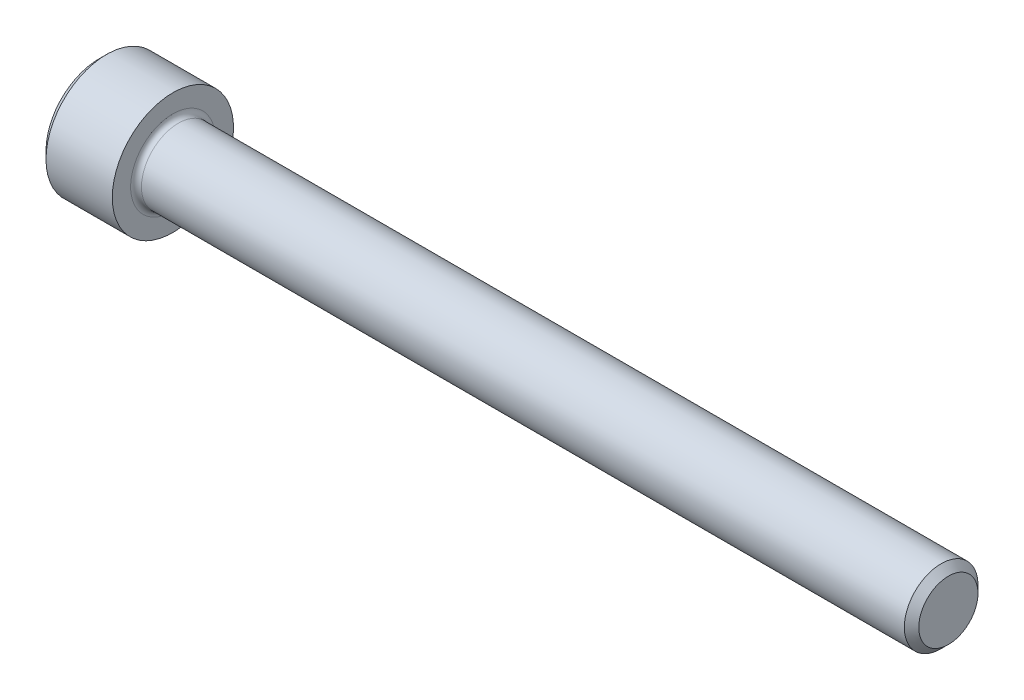
ISO-10303-21;
HEADER;
FILE_DESCRIPTION(('STEP AP214'),'2;1');
FILE_NAME('part.step','',(''),(''),'','','');
FILE_SCHEMA(('AUTOMOTIVE_DESIGN { 1 0 10303 214 1 1 1 1 }'));
ENDSEC;
DATA;
#1=APPLICATION_CONTEXT('core data for automotive mechanical design processes');
#2=APPLICATION_PROTOCOL_DEFINITION('international standard','automotive_design',2000,#1);
#3=PRODUCT_CONTEXT('',#1,'mechanical');
#4=PRODUCT('Part','Part','',(#3));
#5=PRODUCT_RELATED_PRODUCT_CATEGORY('part','',(#4));
#6=PRODUCT_DEFINITION_FORMATION('','',#4);
#7=PRODUCT_DEFINITION_CONTEXT('part definition',#1,'design');
#8=PRODUCT_DEFINITION('design','',#6,#7);
#9=PRODUCT_DEFINITION_SHAPE('','',#8);
#10=(LENGTH_UNIT() NAMED_UNIT(*) SI_UNIT(.MILLI.,.METRE.));
#11=(NAMED_UNIT(*) PLANE_ANGLE_UNIT() SI_UNIT($,.RADIAN.));
#12=(NAMED_UNIT(*) SI_UNIT($,.STERADIAN.) SOLID_ANGLE_UNIT());
#13=UNCERTAINTY_MEASURE_WITH_UNIT(LENGTH_MEASURE(1.E-05),#10,'distance_accuracy_value','');
#14=(GEOMETRIC_REPRESENTATION_CONTEXT(3) GLOBAL_UNCERTAINTY_ASSIGNED_CONTEXT((#13)) GLOBAL_UNIT_ASSIGNED_CONTEXT((#10,
#11,#12)) REPRESENTATION_CONTEXT('',''));
#15=CARTESIAN_POINT('',(0.,0.,0.));
#16=DIRECTION('',(0.,0.,1.));
#17=DIRECTION('',(1.,0.,0.));
#18=AXIS2_PLACEMENT_3D('',#15,#16,#17);
#19=CARTESIAN_POINT('',(0.,0.,0.));
#20=DIRECTION('',(-1.,0.,0.));
#21=DIRECTION('',(0.,0.,1.));
#22=AXIS2_PLACEMENT_3D('',#19,#20,#21);
#23=PLANE('',#22);
#24=DIRECTION('',(0.,-0.499999999999998,0.86602540378444));
#25=VECTOR('',#24,1.);
#26=CARTESIAN_POINT('',(0.,2.2920921156882,0.));
#27=LINE('',#26,#25);
#28=CARTESIAN_POINT('',(0.,2.2920921156882,0.));
#29=VERTEX_POINT('',#28);
#30=CARTESIAN_POINT('',(0.,1.14604605784411,1.98501));
#31=VERTEX_POINT('',#30);
#32=EDGE_CURVE('E372',#29,#31,#27,.T.);
#33=ORIENTED_EDGE('',*,*,#32,.T.);
#34=DIRECTION('',(0.,1.,0.));
#35=VECTOR('',#34,1.);
#36=CARTESIAN_POINT('',(0.,-1.14604605784409,1.98501));
#37=LINE('',#36,#35);
#38=CARTESIAN_POINT('',(0.,-1.14604605784409,1.98501));
#39=VERTEX_POINT('',#38);
#40=EDGE_CURVE('E128',#39,#31,#37,.T.);
#41=ORIENTED_EDGE('',*,*,#40,.F.);
#42=DIRECTION('',(0.,-0.500000000000001,-0.866025403784438));
#43=VECTOR('',#42,1.);
#44=CARTESIAN_POINT('',(0.,-1.14604605784409,1.98501));
#45=LINE('',#44,#43);
#46=CARTESIAN_POINT('',(0.,-2.29209211568819,0.));
#47=VERTEX_POINT('',#46);
#48=EDGE_CURVE('E375',#39,#47,#45,.T.);
#49=ORIENTED_EDGE('',*,*,#48,.T.);
#50=DIRECTION('',(0.,0.499999999999998,-0.86602540378444));
#51=VECTOR('',#50,1.);
#52=CARTESIAN_POINT('',(0.,-2.29209211568819,0.));
#53=LINE('',#52,#51);
#54=CARTESIAN_POINT('',(0.,-1.1460460578441,-1.98501));
#55=VERTEX_POINT('',#54);
#56=EDGE_CURVE('E378',#47,#55,#53,.T.);
#57=ORIENTED_EDGE('',*,*,#56,.T.);
#58=DIRECTION('',(0.,-1.,0.));
#59=VECTOR('',#58,1.);
#60=CARTESIAN_POINT('',(0.,1.1460460578441,-1.98501));
#61=LINE('',#60,#59);
#62=CARTESIAN_POINT('',(0.,1.1460460578441,-1.98501));
#63=VERTEX_POINT('',#62);
#64=EDGE_CURVE('E381',#63,#55,#61,.T.);
#65=ORIENTED_EDGE('',*,*,#64,.F.);
#66=DIRECTION('',(0.,-0.500000000000001,-0.866025403784438));
#67=VECTOR('',#66,1.);
#68=CARTESIAN_POINT('',(0.,2.2920921156882,0.));
#69=LINE('',#68,#67);
#70=EDGE_CURVE('E123',#29,#63,#69,.T.);
#71=ORIENTED_EDGE('',*,*,#70,.F.);
#72=EDGE_LOOP('',(#33,#41,#49,#57,#65,#71));
#73=FACE_BOUND('',#72,.T.);
#74=CARTESIAN_POINT('',(0.,0.,0.));
#75=DIRECTION('',(-1.,0.,0.));
#76=DIRECTION('',(0.,0.,1.));
#77=AXIS2_PLACEMENT_3D('',#74,#75,#76);
#78=CIRCLE('',#77,3.48615);
#79=CARTESIAN_POINT('',(0.,0.,3.48615));
#80=VERTEX_POINT('',#79);
#81=EDGE_CURVE('E139',#80,#80,#78,.T.);
#82=ORIENTED_EDGE('',*,*,#81,.T.);
#83=EDGE_LOOP('',(#82));
#84=FACE_BOUND('',#83,.T.);
#85=ADVANCED_FACE('F32',(#73,#84),#23,.T.);
#86=CARTESIAN_POINT('',(55.626,1.94056,0.));
#87=DIRECTION('',(1.,0.,0.));
#88=DIRECTION('',(0.,0.,-1.));
#89=AXIS2_PLACEMENT_3D('',#86,#87,#88);
#90=PLANE('',#89);
#91=CARTESIAN_POINT('',(55.626,0.,0.));
#92=DIRECTION('',(-1.,0.,0.));
#93=DIRECTION('',(0.,0.,1.));
#94=AXIS2_PLACEMENT_3D('',#91,#92,#93);
#95=CIRCLE('',#94,1.94056);
#96=CARTESIAN_POINT('',(55.626,0.,1.94056));
#97=VERTEX_POINT('',#96);
#98=EDGE_CURVE('E152',#97,#97,#95,.T.);
#99=ORIENTED_EDGE('',*,*,#98,.F.);
#100=EDGE_LOOP('',(#99));
#101=FACE_BOUND('',#100,.T.);
#102=ADVANCED_FACE('F173',(#101),#90,.T.);
#103=CARTESIAN_POINT('',(55.626,0.,0.));
#104=DIRECTION('',(-1.,0.,0.));
#105=DIRECTION('',(0.,0.,1.));
#106=AXIS2_PLACEMENT_3D('',#103,#104,#105);
#107=CONICAL_SURFACE('',#106,1.94056,0.785398163397428);
#108=CARTESIAN_POINT('',(55.15356,0.,0.));
#109=DIRECTION('',(-1.,0.,0.));
#110=DIRECTION('',(0.,0.,1.));
#111=AXIS2_PLACEMENT_3D('',#108,#109,#110);
#112=CIRCLE('',#111,2.41299999999999);
#113=CARTESIAN_POINT('',(55.15356,0.,2.41299999999999));
#114=VERTEX_POINT('',#113);
#115=EDGE_CURVE('E149',#114,#114,#112,.T.);
#116=ORIENTED_EDGE('',*,*,#115,.F.);
#117=EDGE_LOOP('',(#116));
#118=FACE_BOUND('',#117,.T.);
#119=ORIENTED_EDGE('',*,*,#98,.T.);
#120=EDGE_LOOP('',(#119));
#121=FACE_BOUND('',#120,.T.);
#122=ADVANCED_FACE('F179',(#118,#121),#107,.T.);
#123=CARTESIAN_POINT('',(-31.75,0.,0.));
#124=DIRECTION('',(-1.,0.,0.));
#125=DIRECTION('',(0.,0.,1.));
#126=AXIS2_PLACEMENT_3D('',#123,#124,#125);
#127=CYLINDRICAL_SURFACE('',#126,2.41299999999999);
#128=CARTESIAN_POINT('',(5.1816,0.,0.));
#129=DIRECTION('',(1.,0.,0.));
#130=DIRECTION('',(0.,0.,-1.));
#131=AXIS2_PLACEMENT_3D('',#128,#129,#130);
#132=CIRCLE('',#131,2.41299999999999);
#133=CARTESIAN_POINT('',(5.1816,0.,-2.41299999999999));
#134=VERTEX_POINT('',#133);
#135=EDGE_CURVE('E11',#134,#134,#132,.T.);
#136=ORIENTED_EDGE('',*,*,#135,.T.);
#137=EDGE_LOOP('',(#136));
#138=FACE_BOUND('',#137,.T.);
#139=ORIENTED_EDGE('',*,*,#115,.T.);
#140=EDGE_LOOP('',(#139));
#141=FACE_BOUND('',#140,.T.);
#142=ADVANCED_FACE('F190',(#138,#141),#127,.T.);
#143=CARTESIAN_POINT('',(4.826,3.96875,0.));
#144=DIRECTION('',(1.,0.,0.));
#145=DIRECTION('',(0.,0.,-1.));
#146=AXIS2_PLACEMENT_3D('',#143,#144,#145);
#147=PLANE('',#146);
#148=CARTESIAN_POINT('',(4.826,0.,0.));
#149=DIRECTION('',(1.,0.,0.));
#150=DIRECTION('',(0.,0.,-1.));
#151=AXIS2_PLACEMENT_3D('',#148,#149,#150);
#152=CIRCLE('',#151,2.76859999999999);
#153=CARTESIAN_POINT('',(4.826,0.,-2.76859999999999));
#154=VERTEX_POINT('',#153);
#155=EDGE_CURVE('E40',#154,#154,#152,.F.);
#156=ORIENTED_EDGE('',*,*,#155,.T.);
#157=EDGE_LOOP('',(#156));
#158=FACE_BOUND('',#157,.T.);
#159=CARTESIAN_POINT('',(4.826,0.,0.));
#160=DIRECTION('',(-1.,0.,0.));
#161=DIRECTION('',(0.,0.,1.));
#162=AXIS2_PLACEMENT_3D('',#159,#160,#161);
#163=CIRCLE('',#162,3.96875);
#164=CARTESIAN_POINT('',(4.826,0.,3.96875));
#165=VERTEX_POINT('',#164);
#166=EDGE_CURVE('E146',#165,#165,#163,.T.);
#167=ORIENTED_EDGE('',*,*,#166,.F.);
#168=EDGE_LOOP('',(#167));
#169=FACE_BOUND('',#168,.T.);
#170=ADVANCED_FACE('F157',(#158,#169),#147,.T.);
#171=CARTESIAN_POINT('',(-31.75,0.,0.));
#172=DIRECTION('',(-1.,0.,0.));
#173=DIRECTION('',(0.,0.,1.));
#174=AXIS2_PLACEMENT_3D('',#171,#172,#173);
#175=CYLINDRICAL_SURFACE('',#174,3.96875);
#176=ORIENTED_EDGE('',*,*,#166,.T.);
#177=EDGE_LOOP('',(#176));
#178=FACE_BOUND('',#177,.T.);
#179=CARTESIAN_POINT('',(0.4826,0.,0.));
#180=DIRECTION('',(-1.,0.,0.));
#181=DIRECTION('',(0.,0.,1.));
#182=AXIS2_PLACEMENT_3D('',#179,#180,#181);
#183=CIRCLE('',#182,3.96875);
#184=CARTESIAN_POINT('',(0.4826,0.,3.96875));
#185=VERTEX_POINT('',#184);
#186=EDGE_CURVE('E143',#185,#185,#183,.T.);
#187=ORIENTED_EDGE('',*,*,#186,.F.);
#188=EDGE_LOOP('',(#187));
#189=FACE_BOUND('',#188,.T.);
#190=ADVANCED_FACE('F168',(#178,#189),#175,.T.);
#191=CARTESIAN_POINT('',(0.,0.,0.));
#192=DIRECTION('',(1.,0.,0.));
#193=DIRECTION('',(0.,0.,-1.));
#194=AXIS2_PLACEMENT_3D('',#191,#192,#193);
#195=CONICAL_SURFACE('',#194,3.48615,0.785398163397449);
#196=ORIENTED_EDGE('',*,*,#186,.T.);
#197=EDGE_LOOP('',(#196));
#198=FACE_BOUND('',#197,.T.);
#199=ORIENTED_EDGE('',*,*,#81,.F.);
#200=EDGE_LOOP('',(#199));
#201=FACE_BOUND('',#200,.T.);
#202=ADVANCED_FACE('F161',(#198,#201),#195,.T.);
#203=CARTESIAN_POINT('',(5.1816,0.,0.));
#204=DIRECTION('',(1.,0.,0.));
#205=DIRECTION('',(0.,0.,-1.));
#206=AXIS2_PLACEMENT_3D('',#203,#204,#205);
#207=TOROIDAL_SURFACE('',#206,2.76859999999999,0.3556);
#208=ORIENTED_EDGE('',*,*,#135,.F.);
#209=EDGE_LOOP('',(#208));
#210=FACE_BOUND('',#209,.T.);
#211=ORIENTED_EDGE('',*,*,#155,.F.);
#212=EDGE_LOOP('',(#211));
#213=FACE_BOUND('',#212,.T.);
#214=ADVANCED_FACE('F34',(#210,#213),#207,.F.);
#215=CARTESIAN_POINT('',(2.286,2.2920921156882,0.));
#216=DIRECTION('',(0.,-0.866025403784439,-0.499999999999998));
#217=DIRECTION('',(0.,0.499999999999998,-0.86602540378444));
#218=AXIS2_PLACEMENT_3D('',#215,#216,#217);
#219=PLANE('',#218);
#220=ORIENTED_EDGE('',*,*,#32,.F.);
#221=DIRECTION('',(-1.,0.,0.));
#222=VECTOR('',#221,1.);
#223=CARTESIAN_POINT('',(2.286,2.2920921156882,0.));
#224=LINE('',#223,#222);
#225=CARTESIAN_POINT('',(2.286,2.2920921156882,0.));
#226=VERTEX_POINT('',#225);
#227=EDGE_CURVE('E362',#226,#29,#224,.T.);
#228=ORIENTED_EDGE('',*,*,#227,.F.);
#229=DIRECTION('',(0.,-0.499999999999998,0.86602540378444));
#230=VECTOR('',#229,1.);
#231=CARTESIAN_POINT('',(2.286,2.2920921156882,0.));
#232=LINE('',#231,#230);
#233=CARTESIAN_POINT('',(2.286,1.71906908676615,0.992504999999998));
#234=VERTEX_POINT('',#233);
#235=EDGE_CURVE('E115',#226,#234,#232,.T.);
#236=ORIENTED_EDGE('',*,*,#235,.T.);
#237=CARTESIAN_POINT('',(2.286,1.14604605784411,1.98501));
#238=VERTEX_POINT('',#237);
#239=EDGE_CURVE('E106',#234,#238,#232,.T.);
#240=ORIENTED_EDGE('',*,*,#239,.T.);
#241=DIRECTION('',(-1.,0.,0.));
#242=VECTOR('',#241,1.);
#243=CARTESIAN_POINT('',(2.286,1.14604605784411,1.98501));
#244=LINE('',#243,#242);
#245=EDGE_CURVE('E120',#238,#31,#244,.T.);
#246=ORIENTED_EDGE('',*,*,#245,.T.);
#247=EDGE_LOOP('',(#220,#228,#236,#240,#246));
#248=FACE_BOUND('',#247,.T.);
#249=ADVANCED_FACE('F119',(#248),#219,.T.);
#250=CARTESIAN_POINT('',(2.286,-1.14604605784409,1.98501));
#251=DIRECTION('',(0.,0.,1.));
#252=DIRECTION('',(0.,-1.,0.));
#253=AXIS2_PLACEMENT_3D('',#250,#251,#252);
#254=PLANE('',#253);
#255=ORIENTED_EDGE('',*,*,#40,.T.);
#256=ORIENTED_EDGE('',*,*,#245,.F.);
#257=DIRECTION('',(0.,1.,0.));
#258=VECTOR('',#257,1.);
#259=CARTESIAN_POINT('',(2.286,-1.14604605784409,1.98501));
#260=LINE('',#259,#258);
#261=CARTESIAN_POINT('',(2.286,0.,1.98501));
#262=VERTEX_POINT('',#261);
#263=EDGE_CURVE('E103',#262,#238,#260,.T.);
#264=ORIENTED_EDGE('',*,*,#263,.F.);
#265=CARTESIAN_POINT('',(2.286,-1.14604605784409,1.98501));
#266=VERTEX_POINT('',#265);
#267=EDGE_CURVE('E114',#266,#262,#260,.T.);
#268=ORIENTED_EDGE('',*,*,#267,.F.);
#269=DIRECTION('',(-1.,0.,0.));
#270=VECTOR('',#269,1.);
#271=CARTESIAN_POINT('',(2.286,-1.14604605784409,1.98501));
#272=LINE('',#271,#270);
#273=EDGE_CURVE('E130',#266,#39,#272,.T.);
#274=ORIENTED_EDGE('',*,*,#273,.T.);
#275=EDGE_LOOP('',(#255,#256,#264,#268,#274));
#276=FACE_BOUND('',#275,.T.);
#277=ADVANCED_FACE('F125',(#276),#254,.F.);
#278=CARTESIAN_POINT('',(2.286,-1.14604605784409,1.98501));
#279=DIRECTION('',(0.,0.866025403784438,-0.500000000000001));
#280=DIRECTION('',(0.,0.500000000000001,0.866025403784438));
#281=AXIS2_PLACEMENT_3D('',#278,#279,#280);
#282=PLANE('',#281);
#283=ORIENTED_EDGE('',*,*,#48,.F.);
#284=ORIENTED_EDGE('',*,*,#273,.F.);
#285=DIRECTION('',(0.,-0.500000000000001,-0.866025403784438));
#286=VECTOR('',#285,1.);
#287=CARTESIAN_POINT('',(2.286,-1.14604605784409,1.98501));
#288=LINE('',#287,#286);
#289=CARTESIAN_POINT('',(2.286,-1.71906908676614,0.992504999999998));
#290=VERTEX_POINT('',#289);
#291=EDGE_CURVE('E401',#266,#290,#288,.T.);
#292=ORIENTED_EDGE('',*,*,#291,.T.);
#293=CARTESIAN_POINT('',(2.286,-2.29209211568819,0.));
#294=VERTEX_POINT('',#293);
#295=EDGE_CURVE('E390',#290,#294,#288,.T.);
#296=ORIENTED_EDGE('',*,*,#295,.T.);
#297=DIRECTION('',(-1.,0.,0.));
#298=VECTOR('',#297,1.);
#299=CARTESIAN_POINT('',(2.286,-2.29209211568819,0.));
#300=LINE('',#299,#298);
#301=EDGE_CURVE('E135',#294,#47,#300,.T.);
#302=ORIENTED_EDGE('',*,*,#301,.T.);
#303=EDGE_LOOP('',(#283,#284,#292,#296,#302));
#304=FACE_BOUND('',#303,.T.);
#305=ADVANCED_FACE('F253',(#304),#282,.T.);
#306=CARTESIAN_POINT('',(2.286,-2.29209211568819,0.));
#307=DIRECTION('',(0.,0.86602540378444,0.499999999999998));
#308=DIRECTION('',(0.,-0.499999999999998,0.86602540378444));
#309=AXIS2_PLACEMENT_3D('',#306,#307,#308);
#310=PLANE('',#309);
#311=ORIENTED_EDGE('',*,*,#56,.F.);
#312=ORIENTED_EDGE('',*,*,#301,.F.);
#313=DIRECTION('',(0.,0.499999999999998,-0.86602540378444));
#314=VECTOR('',#313,1.);
#315=CARTESIAN_POINT('',(2.286,-2.29209211568819,0.));
#316=LINE('',#315,#314);
#317=CARTESIAN_POINT('',(2.286,-1.71906908676615,-0.992504999999994));
#318=VERTEX_POINT('',#317);
#319=EDGE_CURVE('E368',#294,#318,#316,.T.);
#320=ORIENTED_EDGE('',*,*,#319,.T.);
#321=CARTESIAN_POINT('',(2.286,-1.1460460578441,-1.98501));
#322=VERTEX_POINT('',#321);
#323=EDGE_CURVE('E400',#318,#322,#316,.T.);
#324=ORIENTED_EDGE('',*,*,#323,.T.);
#325=DIRECTION('',(-1.,0.,0.));
#326=VECTOR('',#325,1.);
#327=CARTESIAN_POINT('',(2.286,-1.1460460578441,-1.98501));
#328=LINE('',#327,#326);
#329=EDGE_CURVE('E361',#322,#55,#328,.T.);
#330=ORIENTED_EDGE('',*,*,#329,.T.);
#331=EDGE_LOOP('',(#311,#312,#320,#324,#330));
#332=FACE_BOUND('',#331,.T.);
#333=ADVANCED_FACE('F261',(#332),#310,.T.);
#334=CARTESIAN_POINT('',(2.286,1.1460460578441,-1.98501));
#335=DIRECTION('',(0.,0.,-1.));
#336=DIRECTION('',(0.,1.,0.));
#337=AXIS2_PLACEMENT_3D('',#334,#335,#336);
#338=PLANE('',#337);
#339=ORIENTED_EDGE('',*,*,#64,.T.);
#340=ORIENTED_EDGE('',*,*,#329,.F.);
#341=DIRECTION('',(0.,-1.,0.));
#342=VECTOR('',#341,1.);
#343=CARTESIAN_POINT('',(2.286,1.1460460578441,-1.98501));
#344=LINE('',#343,#342);
#345=CARTESIAN_POINT('',(2.286,0.,-1.98501));
#346=VERTEX_POINT('',#345);
#347=EDGE_CURVE('E365',#346,#322,#344,.T.);
#348=ORIENTED_EDGE('',*,*,#347,.F.);
#349=CARTESIAN_POINT('',(2.286,1.1460460578441,-1.98501));
#350=VERTEX_POINT('',#349);
#351=EDGE_CURVE('E47',#350,#346,#344,.T.);
#352=ORIENTED_EDGE('',*,*,#351,.F.);
#353=DIRECTION('',(-1.,0.,0.));
#354=VECTOR('',#353,1.);
#355=CARTESIAN_POINT('',(2.286,1.1460460578441,-1.98501));
#356=LINE('',#355,#354);
#357=EDGE_CURVE('E358',#350,#63,#356,.T.);
#358=ORIENTED_EDGE('',*,*,#357,.T.);
#359=EDGE_LOOP('',(#339,#340,#348,#352,#358));
#360=FACE_BOUND('',#359,.T.);
#361=ADVANCED_FACE('F270',(#360),#338,.F.);
#362=CARTESIAN_POINT('',(2.286,2.2920921156882,0.));
#363=DIRECTION('',(0.,0.866025403784438,-0.500000000000001));
#364=DIRECTION('',(0.,0.500000000000001,0.866025403784438));
#365=AXIS2_PLACEMENT_3D('',#362,#363,#364);
#366=PLANE('',#365);
#367=ORIENTED_EDGE('',*,*,#70,.T.);
#368=ORIENTED_EDGE('',*,*,#357,.F.);
#369=DIRECTION('',(0.,-0.500000000000001,-0.866025403784438));
#370=VECTOR('',#369,1.);
#371=CARTESIAN_POINT('',(2.286,2.2920921156882,0.));
#372=LINE('',#371,#370);
#373=CARTESIAN_POINT('',(2.286,1.71906908676615,-0.992505000000005));
#374=VERTEX_POINT('',#373);
#375=EDGE_CURVE('E348',#374,#350,#372,.T.);
#376=ORIENTED_EDGE('',*,*,#375,.F.);
#377=EDGE_CURVE('E354',#226,#374,#372,.T.);
#378=ORIENTED_EDGE('',*,*,#377,.F.);
#379=ORIENTED_EDGE('',*,*,#227,.T.);
#380=EDGE_LOOP('',(#367,#368,#376,#378,#379));
#381=FACE_BOUND('',#380,.T.);
#382=ADVANCED_FACE('F279',(#381),#366,.F.);
#383=CARTESIAN_POINT('',(2.286,3.4381381735323,-1.98501000000001));
#384=DIRECTION('',(1.,0.,0.));
#385=DIRECTION('',(0.,0.,-1.));
#386=AXIS2_PLACEMENT_3D('',#383,#384,#385);
#387=PLANE('',#386);
#388=ORIENTED_EDGE('',*,*,#347,.T.);
#389=ORIENTED_EDGE('',*,*,#323,.F.);
#390=CARTESIAN_POINT('',(2.286,0.,0.));
#391=DIRECTION('',(-1.,0.,0.));
#392=DIRECTION('',(0.,0.,1.));
#393=AXIS2_PLACEMENT_3D('',#390,#391,#392);
#394=CIRCLE('',#393,1.98501);
#395=EDGE_CURVE('E396',#346,#318,#394,.T.);
#396=ORIENTED_EDGE('',*,*,#395,.F.);
#397=EDGE_LOOP('',(#388,#389,#396));
#398=FACE_BOUND('',#397,.T.);
#399=ADVANCED_FACE('F288',(#398),#387,.F.);
#400=ORIENTED_EDGE('',*,*,#319,.F.);
#401=ORIENTED_EDGE('',*,*,#295,.F.);
#402=EDGE_CURVE('E133',#318,#290,#394,.T.);
#403=ORIENTED_EDGE('',*,*,#402,.F.);
#404=EDGE_LOOP('',(#400,#401,#403));
#405=FACE_BOUND('',#404,.T.);
#406=ADVANCED_FACE('F297',(#405),#387,.F.);
#407=ORIENTED_EDGE('',*,*,#291,.F.);
#408=ORIENTED_EDGE('',*,*,#267,.T.);
#409=EDGE_CURVE('E129',#290,#262,#394,.T.);
#410=ORIENTED_EDGE('',*,*,#409,.F.);
#411=EDGE_LOOP('',(#407,#408,#410));
#412=FACE_BOUND('',#411,.T.);
#413=ADVANCED_FACE('F306',(#412),#387,.F.);
#414=ORIENTED_EDGE('',*,*,#263,.T.);
#415=ORIENTED_EDGE('',*,*,#239,.F.);
#416=EDGE_CURVE('E109',#262,#234,#394,.T.);
#417=ORIENTED_EDGE('',*,*,#416,.F.);
#418=EDGE_LOOP('',(#414,#415,#417));
#419=FACE_BOUND('',#418,.T.);
#420=ADVANCED_FACE('F105',(#419),#387,.F.);
#421=ORIENTED_EDGE('',*,*,#235,.F.);
#422=ORIENTED_EDGE('',*,*,#377,.T.);
#423=EDGE_CURVE('E140',#234,#374,#394,.T.);
#424=ORIENTED_EDGE('',*,*,#423,.F.);
#425=EDGE_LOOP('',(#421,#422,#424));
#426=FACE_BOUND('',#425,.T.);
#427=ADVANCED_FACE('F321',(#426),#387,.F.);
#428=ORIENTED_EDGE('',*,*,#375,.T.);
#429=ORIENTED_EDGE('',*,*,#351,.T.);
#430=EDGE_CURVE('E351',#374,#346,#394,.T.);
#431=ORIENTED_EDGE('',*,*,#430,.F.);
#432=EDGE_LOOP('',(#428,#429,#431));
#433=FACE_BOUND('',#432,.T.);
#434=ADVANCED_FACE('F236',(#433),#387,.F.);
#435=CARTESIAN_POINT('',(2.286,0.,0.));
#436=DIRECTION('',(-1.,0.,0.));
#437=DIRECTION('',(0.,0.,1.));
#438=AXIS2_PLACEMENT_3D('',#435,#436,#437);
#439=CONICAL_SURFACE('',#438,1.98501,1.04719755119659);
#440=CARTESIAN_POINT('',(3.43204605784411,0.,0.));
#441=VERTEX_POINT('',#440);
#442=VERTEX_LOOP('',#441);
#443=FACE_BOUND('',#442,.T.);
#444=ORIENTED_EDGE('',*,*,#416,.T.);
#445=ORIENTED_EDGE('',*,*,#423,.T.);
#446=ORIENTED_EDGE('',*,*,#430,.T.);
#447=ORIENTED_EDGE('',*,*,#395,.T.);
#448=ORIENTED_EDGE('',*,*,#402,.T.);
#449=ORIENTED_EDGE('',*,*,#409,.T.);
#450=EDGE_LOOP('',(#444,#445,#446,#447,#448,#449));
#451=FACE_BOUND('',#450,.T.);
#452=ADVANCED_FACE('F183',(#443,#451),#439,.F.);
#453=CLOSED_SHELL('',(#85,#102,#122,#142,#170,#190,#202,#214,#249,#277,#305,#333,#361,#382,#399,
#406,#413,#420,#427,#434,#452));
#454=MANIFOLD_SOLID_BREP('B2',#453);
#455=ADVANCED_BREP_SHAPE_REPRESENTATION('',(#18,#454),#14);
#456=SHAPE_DEFINITION_REPRESENTATION(#9,#455);
ENDSEC;
END-ISO-10303-21;
